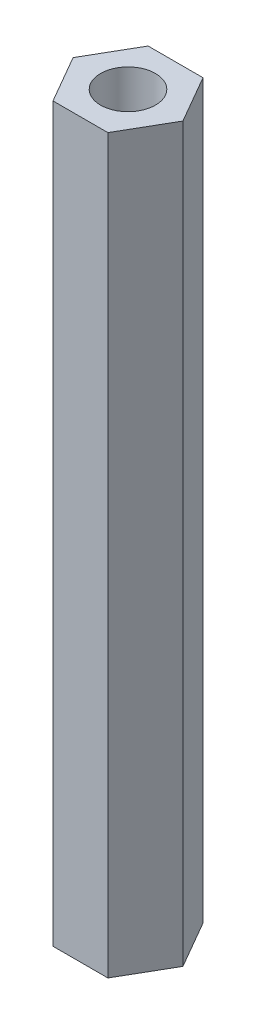
ISO-10303-21;
HEADER;
FILE_DESCRIPTION(('STEP AP214'),'2;1');
FILE_NAME('part.step','',(''),(''),'','','');
FILE_SCHEMA(('AUTOMOTIVE_DESIGN { 1 0 10303 214 1 1 1 1 }'));
ENDSEC;
DATA;
#1=APPLICATION_CONTEXT('core data for automotive mechanical design processes');
#2=APPLICATION_PROTOCOL_DEFINITION('international standard','automotive_design',2000,#1);
#3=PRODUCT_CONTEXT('',#1,'mechanical');
#4=PRODUCT('Part','Part','',(#3));
#5=PRODUCT_RELATED_PRODUCT_CATEGORY('part','',(#4));
#6=PRODUCT_DEFINITION_FORMATION('','',#4);
#7=PRODUCT_DEFINITION_CONTEXT('part definition',#1,'design');
#8=PRODUCT_DEFINITION('design','',#6,#7);
#9=PRODUCT_DEFINITION_SHAPE('','',#8);
#10=(LENGTH_UNIT() NAMED_UNIT(*) SI_UNIT(.MILLI.,.METRE.));
#11=(NAMED_UNIT(*) PLANE_ANGLE_UNIT() SI_UNIT($,.RADIAN.));
#12=(NAMED_UNIT(*) SI_UNIT($,.STERADIAN.) SOLID_ANGLE_UNIT());
#13=UNCERTAINTY_MEASURE_WITH_UNIT(LENGTH_MEASURE(1.E-05),#10,'distance_accuracy_value','');
#14=(GEOMETRIC_REPRESENTATION_CONTEXT(3) GLOBAL_UNCERTAINTY_ASSIGNED_CONTEXT((#13)) GLOBAL_UNIT_ASSIGNED_CONTEXT((#10,
#11,#12)) REPRESENTATION_CONTEXT('',''));
#15=CARTESIAN_POINT('',(0.,0.,0.));
#16=DIRECTION('',(0.,0.,1.));
#17=DIRECTION('',(1.,0.,0.));
#18=AXIS2_PLACEMENT_3D('',#15,#16,#17);
#19=CARTESIAN_POINT('',(0.,40.,0.));
#20=DIRECTION('',(0.,1.,0.));
#21=DIRECTION('',(0.,0.,1.));
#22=AXIS2_PLACEMENT_3D('',#19,#20,#21);
#23=PLANE('',#22);
#24=DIRECTION('',(0.5,0.,-0.866025403784439));
#25=VECTOR('',#24,1.);
#26=CARTESIAN_POINT('',(1.5,40.,2.59807621135332));
#27=LINE('',#26,#25);
#28=CARTESIAN_POINT('',(1.5,40.,2.59807621135332));
#29=VERTEX_POINT('',#28);
#30=CARTESIAN_POINT('',(3.,40.,0.));
#31=VERTEX_POINT('',#30);
#32=EDGE_CURVE('E146',#29,#31,#27,.T.);
#33=ORIENTED_EDGE('',*,*,#32,.T.);
#34=DIRECTION('',(-0.5,0.,-0.866025403784439));
#35=VECTOR('',#34,1.);
#36=CARTESIAN_POINT('',(3.,40.,0.));
#37=LINE('',#36,#35);
#38=CARTESIAN_POINT('',(1.5,40.,-2.59807621135332));
#39=VERTEX_POINT('',#38);
#40=EDGE_CURVE('E94',#31,#39,#37,.T.);
#41=ORIENTED_EDGE('',*,*,#40,.T.);
#42=DIRECTION('',(-1.,0.,0.));
#43=VECTOR('',#42,1.);
#44=CARTESIAN_POINT('',(1.5,40.,-2.59807621135332));
#45=LINE('',#44,#43);
#46=CARTESIAN_POINT('',(-1.5,40.,-2.59807621135332));
#47=VERTEX_POINT('',#46);
#48=EDGE_CURVE('E107',#39,#47,#45,.T.);
#49=ORIENTED_EDGE('',*,*,#48,.T.);
#50=DIRECTION('',(-0.5,0.,0.866025403784439));
#51=VECTOR('',#50,1.);
#52=CARTESIAN_POINT('',(-1.5,40.,-2.59807621135332));
#53=LINE('',#52,#51);
#54=CARTESIAN_POINT('',(-3.,40.,0.));
#55=VERTEX_POINT('',#54);
#56=EDGE_CURVE('E101',#47,#55,#53,.T.);
#57=ORIENTED_EDGE('',*,*,#56,.T.);
#58=DIRECTION('',(0.5,0.,0.866025403784439));
#59=VECTOR('',#58,1.);
#60=CARTESIAN_POINT('',(-3.,40.,0.));
#61=LINE('',#60,#59);
#62=CARTESIAN_POINT('',(-1.5,40.,2.59807621135332));
#63=VERTEX_POINT('',#62);
#64=EDGE_CURVE('E105',#55,#63,#61,.T.);
#65=ORIENTED_EDGE('',*,*,#64,.T.);
#66=DIRECTION('',(1.,0.,0.));
#67=VECTOR('',#66,1.);
#68=CARTESIAN_POINT('',(-1.5,40.,2.59807621135332));
#69=LINE('',#68,#67);
#70=EDGE_CURVE('E57',#63,#29,#69,.T.);
#71=ORIENTED_EDGE('',*,*,#70,.T.);
#72=EDGE_LOOP('',(#33,#41,#49,#57,#65,#71));
#73=FACE_BOUND('',#72,.T.);
#74=CARTESIAN_POINT('',(0.,40.,0.));
#75=DIRECTION('',(0.,1.,0.));
#76=DIRECTION('',(0.,0.,1.));
#77=AXIS2_PLACEMENT_3D('',#74,#75,#76);
#78=CIRCLE('',#77,1.5);
#79=CARTESIAN_POINT('',(0.,40.,1.5));
#80=VERTEX_POINT('',#79);
#81=EDGE_CURVE('E134',#80,#80,#78,.T.);
#82=ORIENTED_EDGE('',*,*,#81,.F.);
#83=EDGE_LOOP('',(#82));
#84=FACE_BOUND('',#83,.T.);
#85=ADVANCED_FACE('F39',(#73,#84),#23,.T.);
#86=CARTESIAN_POINT('',(0.,0.,0.));
#87=DIRECTION('',(0.,1.,0.));
#88=DIRECTION('',(0.,0.,1.));
#89=AXIS2_PLACEMENT_3D('',#86,#87,#88);
#90=PLANE('',#89);
#91=DIRECTION('',(0.5,0.,-0.866025403784439));
#92=VECTOR('',#91,1.);
#93=CARTESIAN_POINT('',(1.5,0.,2.59807621135332));
#94=LINE('',#93,#92);
#95=CARTESIAN_POINT('',(1.5,0.,2.59807621135332));
#96=VERTEX_POINT('',#95);
#97=CARTESIAN_POINT('',(3.,0.,0.));
#98=VERTEX_POINT('',#97);
#99=EDGE_CURVE('E129',#96,#98,#94,.T.);
#100=ORIENTED_EDGE('',*,*,#99,.F.);
#101=DIRECTION('',(1.,0.,0.));
#102=VECTOR('',#101,1.);
#103=CARTESIAN_POINT('',(-1.5,0.,2.59807621135332));
#104=LINE('',#103,#102);
#105=CARTESIAN_POINT('',(-1.5,0.,2.59807621135332));
#106=VERTEX_POINT('',#105);
#107=EDGE_CURVE('E86',#106,#96,#104,.T.);
#108=ORIENTED_EDGE('',*,*,#107,.F.);
#109=DIRECTION('',(0.5,0.,0.866025403784439));
#110=VECTOR('',#109,1.);
#111=CARTESIAN_POINT('',(-3.,0.,0.));
#112=LINE('',#111,#110);
#113=CARTESIAN_POINT('',(-3.,0.,0.));
#114=VERTEX_POINT('',#113);
#115=EDGE_CURVE('E80',#114,#106,#112,.T.);
#116=ORIENTED_EDGE('',*,*,#115,.F.);
#117=DIRECTION('',(-0.5,0.,0.866025403784439));
#118=VECTOR('',#117,1.);
#119=CARTESIAN_POINT('',(-1.5,0.,-2.59807621135332));
#120=LINE('',#119,#118);
#121=CARTESIAN_POINT('',(-1.5,0.,-2.59807621135332));
#122=VERTEX_POINT('',#121);
#123=EDGE_CURVE('E116',#122,#114,#120,.T.);
#124=ORIENTED_EDGE('',*,*,#123,.F.);
#125=DIRECTION('',(-1.,0.,0.));
#126=VECTOR('',#125,1.);
#127=CARTESIAN_POINT('',(1.5,0.,-2.59807621135332));
#128=LINE('',#127,#126);
#129=CARTESIAN_POINT('',(1.5,0.,-2.59807621135332));
#130=VERTEX_POINT('',#129);
#131=EDGE_CURVE('E137',#130,#122,#128,.T.);
#132=ORIENTED_EDGE('',*,*,#131,.F.);
#133=DIRECTION('',(-0.5,0.,-0.866025403784439));
#134=VECTOR('',#133,1.);
#135=CARTESIAN_POINT('',(3.,0.,0.));
#136=LINE('',#135,#134);
#137=EDGE_CURVE('E133',#98,#130,#136,.T.);
#138=ORIENTED_EDGE('',*,*,#137,.F.);
#139=EDGE_LOOP('',(#100,#108,#116,#124,#132,#138));
#140=FACE_BOUND('',#139,.T.);
#141=CARTESIAN_POINT('',(0.,0.,0.));
#142=DIRECTION('',(0.,1.,0.));
#143=DIRECTION('',(0.,0.,1.));
#144=AXIS2_PLACEMENT_3D('',#141,#142,#143);
#145=CIRCLE('',#144,1.5);
#146=CARTESIAN_POINT('',(0.,0.,1.5));
#147=VERTEX_POINT('',#146);
#148=EDGE_CURVE('E243',#147,#147,#145,.T.);
#149=ORIENTED_EDGE('',*,*,#148,.T.);
#150=EDGE_LOOP('',(#149));
#151=FACE_BOUND('',#150,.T.);
#152=ADVANCED_FACE('F159',(#140,#151),#90,.F.);
#153=CARTESIAN_POINT('',(1.5,40.,2.59807621135332));
#154=DIRECTION('',(-0.866025403784439,0.,-0.5));
#155=DIRECTION('',(-0.5,0.,0.866025403784439));
#156=AXIS2_PLACEMENT_3D('',#153,#154,#155);
#157=PLANE('',#156);
#158=ORIENTED_EDGE('',*,*,#99,.T.);
#159=DIRECTION('',(0.,-1.,0.));
#160=VECTOR('',#159,1.);
#161=CARTESIAN_POINT('',(3.,40.,0.));
#162=LINE('',#161,#160);
#163=EDGE_CURVE('E11',#31,#98,#162,.T.);
#164=ORIENTED_EDGE('',*,*,#163,.F.);
#165=ORIENTED_EDGE('',*,*,#32,.F.);
#166=DIRECTION('',(0.,-1.,0.));
#167=VECTOR('',#166,1.);
#168=CARTESIAN_POINT('',(1.5,40.,2.59807621135332));
#169=LINE('',#168,#167);
#170=EDGE_CURVE('E125',#29,#96,#169,.T.);
#171=ORIENTED_EDGE('',*,*,#170,.T.);
#172=EDGE_LOOP('',(#158,#164,#165,#171));
#173=FACE_BOUND('',#172,.T.);
#174=ADVANCED_FACE('F41',(#173),#157,.F.);
#175=CARTESIAN_POINT('',(3.,40.,0.));
#176=DIRECTION('',(-0.866025403784439,0.,0.5));
#177=DIRECTION('',(0.5,0.,0.866025403784439));
#178=AXIS2_PLACEMENT_3D('',#175,#176,#177);
#179=PLANE('',#178);
#180=ORIENTED_EDGE('',*,*,#137,.T.);
#181=DIRECTION('',(0.,-1.,0.));
#182=VECTOR('',#181,1.);
#183=CARTESIAN_POINT('',(1.5,40.,-2.59807621135332));
#184=LINE('',#183,#182);
#185=EDGE_CURVE('E49',#39,#130,#184,.T.);
#186=ORIENTED_EDGE('',*,*,#185,.F.);
#187=ORIENTED_EDGE('',*,*,#40,.F.);
#188=ORIENTED_EDGE('',*,*,#163,.T.);
#189=EDGE_LOOP('',(#180,#186,#187,#188));
#190=FACE_BOUND('',#189,.T.);
#191=ADVANCED_FACE('F184',(#190),#179,.F.);
#192=CARTESIAN_POINT('',(1.5,40.,-2.59807621135332));
#193=DIRECTION('',(0.,0.,1.));
#194=DIRECTION('',(1.,0.,0.));
#195=AXIS2_PLACEMENT_3D('',#192,#193,#194);
#196=PLANE('',#195);
#197=ORIENTED_EDGE('',*,*,#131,.T.);
#198=DIRECTION('',(0.,-1.,0.));
#199=VECTOR('',#198,1.);
#200=CARTESIAN_POINT('',(-1.5,40.,-2.59807621135332));
#201=LINE('',#200,#199);
#202=EDGE_CURVE('E118',#47,#122,#201,.T.);
#203=ORIENTED_EDGE('',*,*,#202,.F.);
#204=ORIENTED_EDGE('',*,*,#48,.F.);
#205=ORIENTED_EDGE('',*,*,#185,.T.);
#206=EDGE_LOOP('',(#197,#203,#204,#205));
#207=FACE_BOUND('',#206,.T.);
#208=ADVANCED_FACE('F156',(#207),#196,.F.);
#209=CARTESIAN_POINT('',(-1.5,40.,-2.59807621135332));
#210=DIRECTION('',(0.866025403784439,0.,0.5));
#211=DIRECTION('',(0.5,0.,-0.866025403784439));
#212=AXIS2_PLACEMENT_3D('',#209,#210,#211);
#213=PLANE('',#212);
#214=ORIENTED_EDGE('',*,*,#123,.T.);
#215=DIRECTION('',(0.,-1.,0.));
#216=VECTOR('',#215,1.);
#217=CARTESIAN_POINT('',(-3.,40.,0.));
#218=LINE('',#217,#216);
#219=EDGE_CURVE('E113',#55,#114,#218,.T.);
#220=ORIENTED_EDGE('',*,*,#219,.F.);
#221=ORIENTED_EDGE('',*,*,#56,.F.);
#222=ORIENTED_EDGE('',*,*,#202,.T.);
#223=EDGE_LOOP('',(#214,#220,#221,#222));
#224=FACE_BOUND('',#223,.T.);
#225=ADVANCED_FACE('F114',(#224),#213,.F.);
#226=CARTESIAN_POINT('',(-3.,40.,0.));
#227=DIRECTION('',(0.866025403784439,0.,-0.5));
#228=DIRECTION('',(-0.5,0.,-0.866025403784439));
#229=AXIS2_PLACEMENT_3D('',#226,#227,#228);
#230=PLANE('',#229);
#231=ORIENTED_EDGE('',*,*,#115,.T.);
#232=DIRECTION('',(0.,-1.,0.));
#233=VECTOR('',#232,1.);
#234=CARTESIAN_POINT('',(-1.5,40.,2.59807621135332));
#235=LINE('',#234,#233);
#236=EDGE_CURVE('E119',#63,#106,#235,.T.);
#237=ORIENTED_EDGE('',*,*,#236,.F.);
#238=ORIENTED_EDGE('',*,*,#64,.F.);
#239=ORIENTED_EDGE('',*,*,#219,.T.);
#240=EDGE_LOOP('',(#231,#237,#238,#239));
#241=FACE_BOUND('',#240,.T.);
#242=ADVANCED_FACE('F121',(#241),#230,.F.);
#243=CARTESIAN_POINT('',(-1.5,40.,2.59807621135332));
#244=DIRECTION('',(0.,0.,-1.));
#245=DIRECTION('',(-1.,0.,0.));
#246=AXIS2_PLACEMENT_3D('',#243,#244,#245);
#247=PLANE('',#246);
#248=ORIENTED_EDGE('',*,*,#107,.T.);
#249=ORIENTED_EDGE('',*,*,#170,.F.);
#250=ORIENTED_EDGE('',*,*,#70,.F.);
#251=ORIENTED_EDGE('',*,*,#236,.T.);
#252=EDGE_LOOP('',(#248,#249,#250,#251));
#253=FACE_BOUND('',#252,.T.);
#254=ADVANCED_FACE('F164',(#253),#247,.F.);
#255=CARTESIAN_POINT('',(0.,40.,0.));
#256=DIRECTION('',(0.,-1.,0.));
#257=DIRECTION('',(0.,0.,-1.));
#258=AXIS2_PLACEMENT_3D('',#255,#256,#257);
#259=CYLINDRICAL_SURFACE('',#258,1.5);
#260=ORIENTED_EDGE('',*,*,#81,.T.);
#261=EDGE_LOOP('',(#260));
#262=FACE_BOUND('',#261,.T.);
#263=ORIENTED_EDGE('',*,*,#148,.F.);
#264=EDGE_LOOP('',(#263));
#265=FACE_BOUND('',#264,.T.);
#266=ADVANCED_FACE('F166',(#262,#265),#259,.F.);
#267=CLOSED_SHELL('',(#85,#152,#174,#191,#208,#225,#242,#254,#266));
#268=MANIFOLD_SOLID_BREP('B2',#267);
#269=ADVANCED_BREP_SHAPE_REPRESENTATION('',(#18,#268),#14);
#270=SHAPE_DEFINITION_REPRESENTATION(#9,#269);
ENDSEC;
END-ISO-10303-21;
